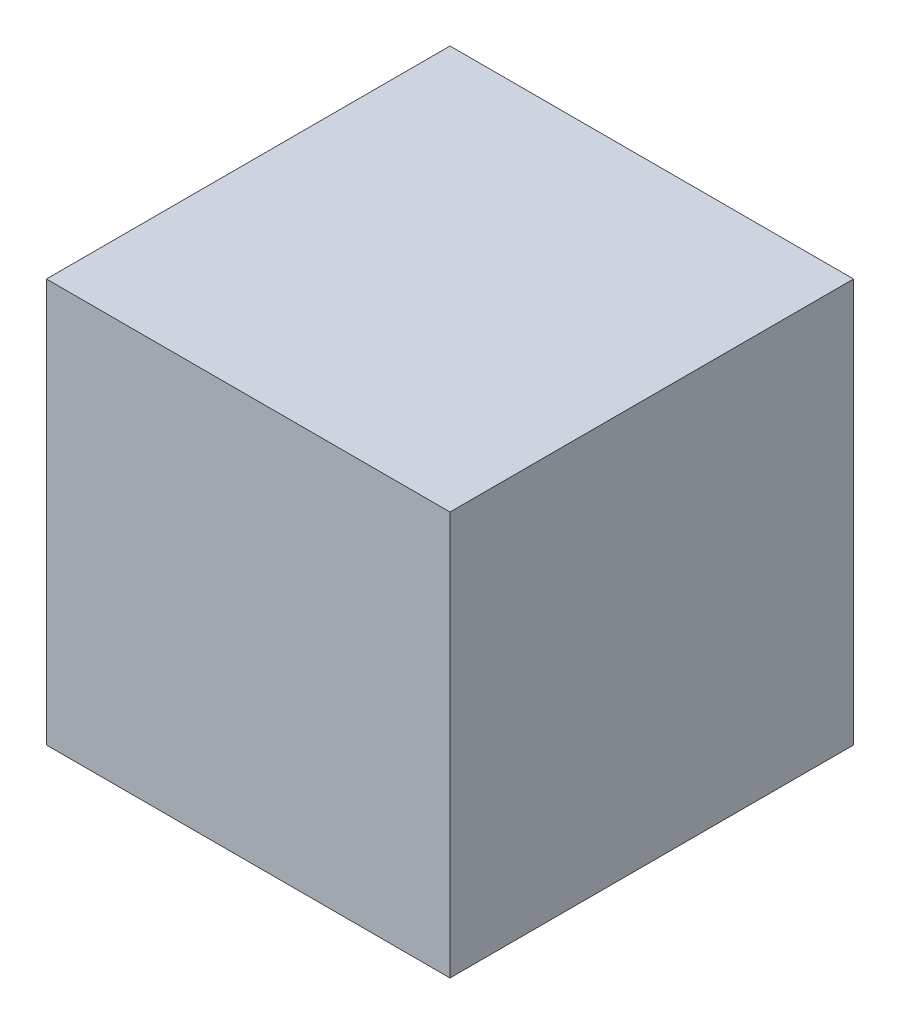
ISO-10303-21;
HEADER;
FILE_DESCRIPTION(('STEP AP214'),'2;1');
FILE_NAME('part.step','',(''),(''),'','','');
FILE_SCHEMA(('AUTOMOTIVE_DESIGN { 1 0 10303 214 1 1 1 1 }'));
ENDSEC;
DATA;
#1=APPLICATION_CONTEXT('core data for automotive mechanical design processes');
#2=APPLICATION_PROTOCOL_DEFINITION('international standard','automotive_design',2000,#1);
#3=PRODUCT_CONTEXT('',#1,'mechanical');
#4=PRODUCT('Part','Part','',(#3));
#5=PRODUCT_RELATED_PRODUCT_CATEGORY('part','',(#4));
#6=PRODUCT_DEFINITION_FORMATION('','',#4);
#7=PRODUCT_DEFINITION_CONTEXT('part definition',#1,'design');
#8=PRODUCT_DEFINITION('design','',#6,#7);
#9=PRODUCT_DEFINITION_SHAPE('','',#8);
#10=(LENGTH_UNIT() NAMED_UNIT(*) SI_UNIT(.MILLI.,.METRE.));
#11=(NAMED_UNIT(*) PLANE_ANGLE_UNIT() SI_UNIT($,.RADIAN.));
#12=(NAMED_UNIT(*) SI_UNIT($,.STERADIAN.) SOLID_ANGLE_UNIT());
#13=UNCERTAINTY_MEASURE_WITH_UNIT(LENGTH_MEASURE(1.E-05),#10,'distance_accuracy_value','');
#14=(GEOMETRIC_REPRESENTATION_CONTEXT(3) GLOBAL_UNCERTAINTY_ASSIGNED_CONTEXT((#13)) GLOBAL_UNIT_ASSIGNED_CONTEXT((#10,
#11,#12)) REPRESENTATION_CONTEXT('',''));
#15=CARTESIAN_POINT('',(0.,0.,0.));
#16=DIRECTION('',(0.,0.,1.));
#17=DIRECTION('',(1.,0.,0.));
#18=AXIS2_PLACEMENT_3D('',#15,#16,#17);
#19=CARTESIAN_POINT('',(0.,0.,100.));
#20=DIRECTION('',(1.,0.,0.));
#21=DIRECTION('',(0.,0.,-1.));
#22=AXIS2_PLACEMENT_3D('',#19,#20,#21);
#23=PLANE('',#22);
#24=DIRECTION('',(0.,-1.,0.));
#25=VECTOR('',#24,1.);
#26=CARTESIAN_POINT('',(0.,0.,0.));
#27=LINE('',#26,#25);
#28=CARTESIAN_POINT('',(0.,100.,0.));
#29=VERTEX_POINT('',#28);
#30=CARTESIAN_POINT('',(0.,0.,0.));
#31=VERTEX_POINT('',#30);
#32=EDGE_CURVE('E94',#29,#31,#27,.T.);
#33=ORIENTED_EDGE('',*,*,#32,.T.);
#34=DIRECTION('',(0.,0.,-1.));
#35=VECTOR('',#34,1.);
#36=CARTESIAN_POINT('',(0.,0.,100.));
#37=LINE('',#36,#35);
#38=CARTESIAN_POINT('',(0.,0.,100.));
#39=VERTEX_POINT('',#38);
#40=EDGE_CURVE('E11',#39,#31,#37,.T.);
#41=ORIENTED_EDGE('',*,*,#40,.F.);
#42=DIRECTION('',(0.,-1.,0.));
#43=VECTOR('',#42,1.);
#44=CARTESIAN_POINT('',(0.,0.,100.));
#45=LINE('',#44,#43);
#46=CARTESIAN_POINT('',(0.,100.,100.));
#47=VERTEX_POINT('',#46);
#48=EDGE_CURVE('E82',#47,#39,#45,.T.);
#49=ORIENTED_EDGE('',*,*,#48,.F.);
#50=DIRECTION('',(0.,0.,-1.));
#51=VECTOR('',#50,1.);
#52=CARTESIAN_POINT('',(0.,100.,100.));
#53=LINE('',#52,#51);
#54=EDGE_CURVE('E90',#47,#29,#53,.T.);
#55=ORIENTED_EDGE('',*,*,#54,.T.);
#56=EDGE_LOOP('',(#33,#41,#49,#55));
#57=FACE_BOUND('',#56,.T.);
#58=ADVANCED_FACE('F31',(#57),#23,.F.);
#59=CARTESIAN_POINT('',(0.,0.,100.));
#60=DIRECTION('',(0.,1.,0.));
#61=DIRECTION('',(0.,0.,1.));
#62=AXIS2_PLACEMENT_3D('',#59,#60,#61);
#63=PLANE('',#62);
#64=DIRECTION('',(1.,0.,0.));
#65=VECTOR('',#64,1.);
#66=CARTESIAN_POINT('',(0.,0.,0.));
#67=LINE('',#66,#65);
#68=CARTESIAN_POINT('',(100.,0.,0.));
#69=VERTEX_POINT('',#68);
#70=EDGE_CURVE('E86',#31,#69,#67,.T.);
#71=ORIENTED_EDGE('',*,*,#70,.T.);
#72=DIRECTION('',(0.,0.,-1.));
#73=VECTOR('',#72,1.);
#74=CARTESIAN_POINT('',(100.,0.,100.));
#75=LINE('',#74,#73);
#76=CARTESIAN_POINT('',(100.,0.,100.));
#77=VERTEX_POINT('',#76);
#78=EDGE_CURVE('E39',#77,#69,#75,.T.);
#79=ORIENTED_EDGE('',*,*,#78,.F.);
#80=DIRECTION('',(1.,0.,0.));
#81=VECTOR('',#80,1.);
#82=CARTESIAN_POINT('',(0.,0.,100.));
#83=LINE('',#82,#81);
#84=EDGE_CURVE('E77',#39,#77,#83,.T.);
#85=ORIENTED_EDGE('',*,*,#84,.F.);
#86=ORIENTED_EDGE('',*,*,#40,.T.);
#87=EDGE_LOOP('',(#71,#79,#85,#86));
#88=FACE_BOUND('',#87,.T.);
#89=ADVANCED_FACE('F85',(#88),#63,.F.);
#90=CARTESIAN_POINT('',(100.,0.,100.));
#91=DIRECTION('',(-1.,0.,0.));
#92=DIRECTION('',(0.,0.,1.));
#93=AXIS2_PLACEMENT_3D('',#90,#91,#92);
#94=PLANE('',#93);
#95=DIRECTION('',(0.,1.,0.));
#96=VECTOR('',#95,1.);
#97=CARTESIAN_POINT('',(100.,0.,0.));
#98=LINE('',#97,#96);
#99=CARTESIAN_POINT('',(100.,100.,0.));
#100=VERTEX_POINT('',#99);
#101=EDGE_CURVE('E64',#69,#100,#98,.T.);
#102=ORIENTED_EDGE('',*,*,#101,.T.);
#103=DIRECTION('',(0.,0.,-1.));
#104=VECTOR('',#103,1.);
#105=CARTESIAN_POINT('',(100.,100.,100.));
#106=LINE('',#105,#104);
#107=CARTESIAN_POINT('',(100.,100.,100.));
#108=VERTEX_POINT('',#107);
#109=EDGE_CURVE('E87',#108,#100,#106,.T.);
#110=ORIENTED_EDGE('',*,*,#109,.F.);
#111=DIRECTION('',(0.,1.,0.));
#112=VECTOR('',#111,1.);
#113=CARTESIAN_POINT('',(100.,0.,100.));
#114=LINE('',#113,#112);
#115=EDGE_CURVE('E80',#77,#108,#114,.T.);
#116=ORIENTED_EDGE('',*,*,#115,.F.);
#117=ORIENTED_EDGE('',*,*,#78,.T.);
#118=EDGE_LOOP('',(#102,#110,#116,#117));
#119=FACE_BOUND('',#118,.T.);
#120=ADVANCED_FACE('F88',(#119),#94,.F.);
#121=CARTESIAN_POINT('',(0.,100.,100.));
#122=DIRECTION('',(0.,-1.,0.));
#123=DIRECTION('',(0.,0.,-1.));
#124=AXIS2_PLACEMENT_3D('',#121,#122,#123);
#125=PLANE('',#124);
#126=DIRECTION('',(-1.,0.,0.));
#127=VECTOR('',#126,1.);
#128=CARTESIAN_POINT('',(0.,100.,0.));
#129=LINE('',#128,#127);
#130=EDGE_CURVE('E70',#100,#29,#129,.T.);
#131=ORIENTED_EDGE('',*,*,#130,.T.);
#132=ORIENTED_EDGE('',*,*,#54,.F.);
#133=DIRECTION('',(-1.,0.,0.));
#134=VECTOR('',#133,1.);
#135=CARTESIAN_POINT('',(0.,100.,100.));
#136=LINE('',#135,#134);
#137=EDGE_CURVE('E47',#108,#47,#136,.T.);
#138=ORIENTED_EDGE('',*,*,#137,.F.);
#139=ORIENTED_EDGE('',*,*,#109,.T.);
#140=EDGE_LOOP('',(#131,#132,#138,#139));
#141=FACE_BOUND('',#140,.T.);
#142=ADVANCED_FACE('F101',(#141),#125,.F.);
#143=CARTESIAN_POINT('',(0.,100.,100.));
#144=DIRECTION('',(0.,0.,-1.));
#145=DIRECTION('',(-1.,0.,0.));
#146=AXIS2_PLACEMENT_3D('',#143,#144,#145);
#147=PLANE('',#146);
#148=ORIENTED_EDGE('',*,*,#48,.T.);
#149=ORIENTED_EDGE('',*,*,#84,.T.);
#150=ORIENTED_EDGE('',*,*,#115,.T.);
#151=ORIENTED_EDGE('',*,*,#137,.T.);
#152=EDGE_LOOP('',(#148,#149,#150,#151));
#153=FACE_BOUND('',#152,.T.);
#154=ADVANCED_FACE('F78',(#153),#147,.F.);
#155=CARTESIAN_POINT('',(0.,100.,0.));
#156=DIRECTION('',(0.,0.,-1.));
#157=DIRECTION('',(-1.,0.,0.));
#158=AXIS2_PLACEMENT_3D('',#155,#156,#157);
#159=PLANE('',#158);
#160=ORIENTED_EDGE('',*,*,#32,.F.);
#161=ORIENTED_EDGE('',*,*,#130,.F.);
#162=ORIENTED_EDGE('',*,*,#101,.F.);
#163=ORIENTED_EDGE('',*,*,#70,.F.);
#164=EDGE_LOOP('',(#160,#161,#162,#163));
#165=FACE_BOUND('',#164,.T.);
#166=ADVANCED_FACE('F104',(#165),#159,.T.);
#167=CLOSED_SHELL('',(#58,#89,#120,#142,#154,#166));
#168=MANIFOLD_SOLID_BREP('B2',#167);
#169=ADVANCED_BREP_SHAPE_REPRESENTATION('',(#18,#168),#14);
#170=SHAPE_DEFINITION_REPRESENTATION(#9,#169);
ENDSEC;
END-ISO-10303-21;
